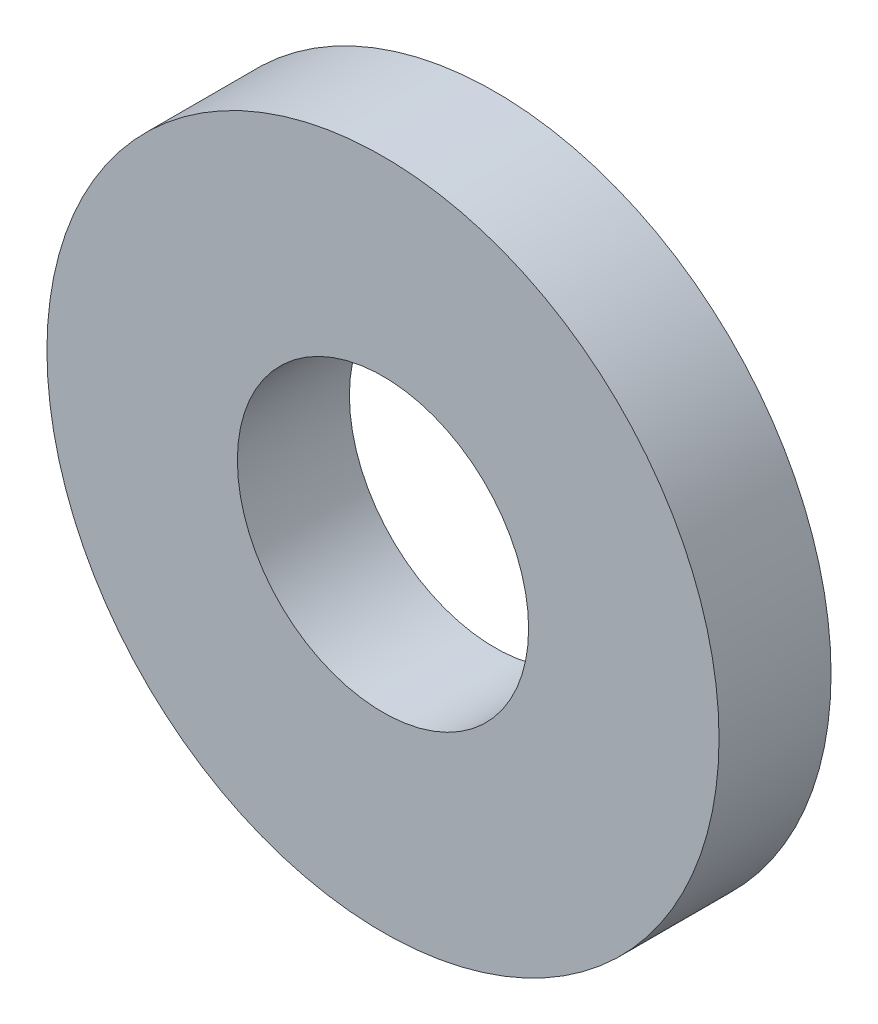
ISO-10303-21;
HEADER;
FILE_DESCRIPTION(('STEP AP214'),'2;1');
FILE_NAME('part.step','',(''),(''),'','','');
FILE_SCHEMA(('AUTOMOTIVE_DESIGN { 1 0 10303 214 1 1 1 1 }'));
ENDSEC;
DATA;
#1=APPLICATION_CONTEXT('core data for automotive mechanical design processes');
#2=APPLICATION_PROTOCOL_DEFINITION('international standard','automotive_design',2000,#1);
#3=PRODUCT_CONTEXT('',#1,'mechanical');
#4=PRODUCT('Part','Part','',(#3));
#5=PRODUCT_RELATED_PRODUCT_CATEGORY('part','',(#4));
#6=PRODUCT_DEFINITION_FORMATION('','',#4);
#7=PRODUCT_DEFINITION_CONTEXT('part definition',#1,'design');
#8=PRODUCT_DEFINITION('design','',#6,#7);
#9=PRODUCT_DEFINITION_SHAPE('','',#8);
#10=(LENGTH_UNIT() NAMED_UNIT(*) SI_UNIT(.MILLI.,.METRE.));
#11=(NAMED_UNIT(*) PLANE_ANGLE_UNIT() SI_UNIT($,.RADIAN.));
#12=(NAMED_UNIT(*) SI_UNIT($,.STERADIAN.) SOLID_ANGLE_UNIT());
#13=UNCERTAINTY_MEASURE_WITH_UNIT(LENGTH_MEASURE(1.E-05),#10,'distance_accuracy_value','');
#14=(GEOMETRIC_REPRESENTATION_CONTEXT(3) GLOBAL_UNCERTAINTY_ASSIGNED_CONTEXT((#13)) GLOBAL_UNIT_ASSIGNED_CONTEXT((#10,
#11,#12)) REPRESENTATION_CONTEXT('',''));
#15=CARTESIAN_POINT('',(0.,0.,0.));
#16=DIRECTION('',(0.,0.,1.));
#17=DIRECTION('',(1.,0.,0.));
#18=AXIS2_PLACEMENT_3D('',#15,#16,#17);
#19=CARTESIAN_POINT('',(0.,0.,2.));
#20=DIRECTION('',(0.,0.,1.));
#21=DIRECTION('',(1.,0.,0.));
#22=AXIS2_PLACEMENT_3D('',#19,#20,#21);
#23=PLANE('',#22);
#24=CARTESIAN_POINT('',(0.,0.,2.));
#25=DIRECTION('',(0.,0.,1.));
#26=DIRECTION('',(1.,0.,0.));
#27=AXIS2_PLACEMENT_3D('',#24,#25,#26);
#28=CIRCLE('',#27,6.);
#29=CARTESIAN_POINT('',(6.,0.,2.));
#30=VERTEX_POINT('',#29);
#31=EDGE_CURVE('E10',#30,#30,#28,.T.);
#32=ORIENTED_EDGE('',*,*,#31,.T.);
#33=EDGE_LOOP('',(#32));
#34=FACE_BOUND('',#33,.T.);
#35=CARTESIAN_POINT('',(0.,0.,2.));
#36=DIRECTION('',(0.,0.,1.));
#37=DIRECTION('',(1.,0.,0.));
#38=AXIS2_PLACEMENT_3D('',#35,#36,#37);
#39=CIRCLE('',#38,2.6);
#40=CARTESIAN_POINT('',(2.6,0.,2.));
#41=VERTEX_POINT('',#40);
#42=EDGE_CURVE('E42',#41,#41,#39,.T.);
#43=ORIENTED_EDGE('',*,*,#42,.F.);
#44=EDGE_LOOP('',(#43));
#45=FACE_BOUND('',#44,.T.);
#46=ADVANCED_FACE('F31',(#34,#45),#23,.T.);
#47=CARTESIAN_POINT('',(0.,0.,0.));
#48=DIRECTION('',(0.,0.,1.));
#49=DIRECTION('',(1.,0.,0.));
#50=AXIS2_PLACEMENT_3D('',#47,#48,#49);
#51=PLANE('',#50);
#52=CARTESIAN_POINT('',(0.,0.,0.));
#53=DIRECTION('',(0.,0.,1.));
#54=DIRECTION('',(1.,0.,0.));
#55=AXIS2_PLACEMENT_3D('',#52,#53,#54);
#56=CIRCLE('',#55,6.);
#57=CARTESIAN_POINT('',(6.,0.,0.));
#58=VERTEX_POINT('',#57);
#59=EDGE_CURVE('E35',#58,#58,#56,.T.);
#60=ORIENTED_EDGE('',*,*,#59,.F.);
#61=EDGE_LOOP('',(#60));
#62=FACE_BOUND('',#61,.T.);
#63=CARTESIAN_POINT('',(0.,0.,0.));
#64=DIRECTION('',(0.,0.,1.));
#65=DIRECTION('',(1.,0.,0.));
#66=AXIS2_PLACEMENT_3D('',#63,#64,#65);
#67=CIRCLE('',#66,2.6);
#68=CARTESIAN_POINT('',(2.6,0.,0.));
#69=VERTEX_POINT('',#68);
#70=EDGE_CURVE('E44',#69,#69,#67,.T.);
#71=ORIENTED_EDGE('',*,*,#70,.T.);
#72=EDGE_LOOP('',(#71));
#73=FACE_BOUND('',#72,.T.);
#74=ADVANCED_FACE('F54',(#62,#73),#51,.F.);
#75=CARTESIAN_POINT('',(0.,0.,2.));
#76=DIRECTION('',(0.,0.,-1.));
#77=DIRECTION('',(-1.,0.,0.));
#78=AXIS2_PLACEMENT_3D('',#75,#76,#77);
#79=CYLINDRICAL_SURFACE('',#78,6.);
#80=ORIENTED_EDGE('',*,*,#31,.F.);
#81=EDGE_LOOP('',(#80));
#82=FACE_BOUND('',#81,.T.);
#83=ORIENTED_EDGE('',*,*,#59,.T.);
#84=EDGE_LOOP('',(#83));
#85=FACE_BOUND('',#84,.T.);
#86=ADVANCED_FACE('F33',(#82,#85),#79,.T.);
#87=CARTESIAN_POINT('',(0.,0.,2.));
#88=DIRECTION('',(0.,0.,-1.));
#89=DIRECTION('',(-1.,0.,0.));
#90=AXIS2_PLACEMENT_3D('',#87,#88,#89);
#91=CYLINDRICAL_SURFACE('',#90,2.6);
#92=ORIENTED_EDGE('',*,*,#42,.T.);
#93=EDGE_LOOP('',(#92));
#94=FACE_BOUND('',#93,.T.);
#95=ORIENTED_EDGE('',*,*,#70,.F.);
#96=EDGE_LOOP('',(#95));
#97=FACE_BOUND('',#96,.T.);
#98=ADVANCED_FACE('F50',(#94,#97),#91,.F.);
#99=CLOSED_SHELL('',(#46,#74,#86,#98));
#100=MANIFOLD_SOLID_BREP('B2',#99);
#101=ADVANCED_BREP_SHAPE_REPRESENTATION('',(#18,#100),#14);
#102=SHAPE_DEFINITION_REPRESENTATION(#9,#101);
ENDSEC;
END-ISO-10303-21;
